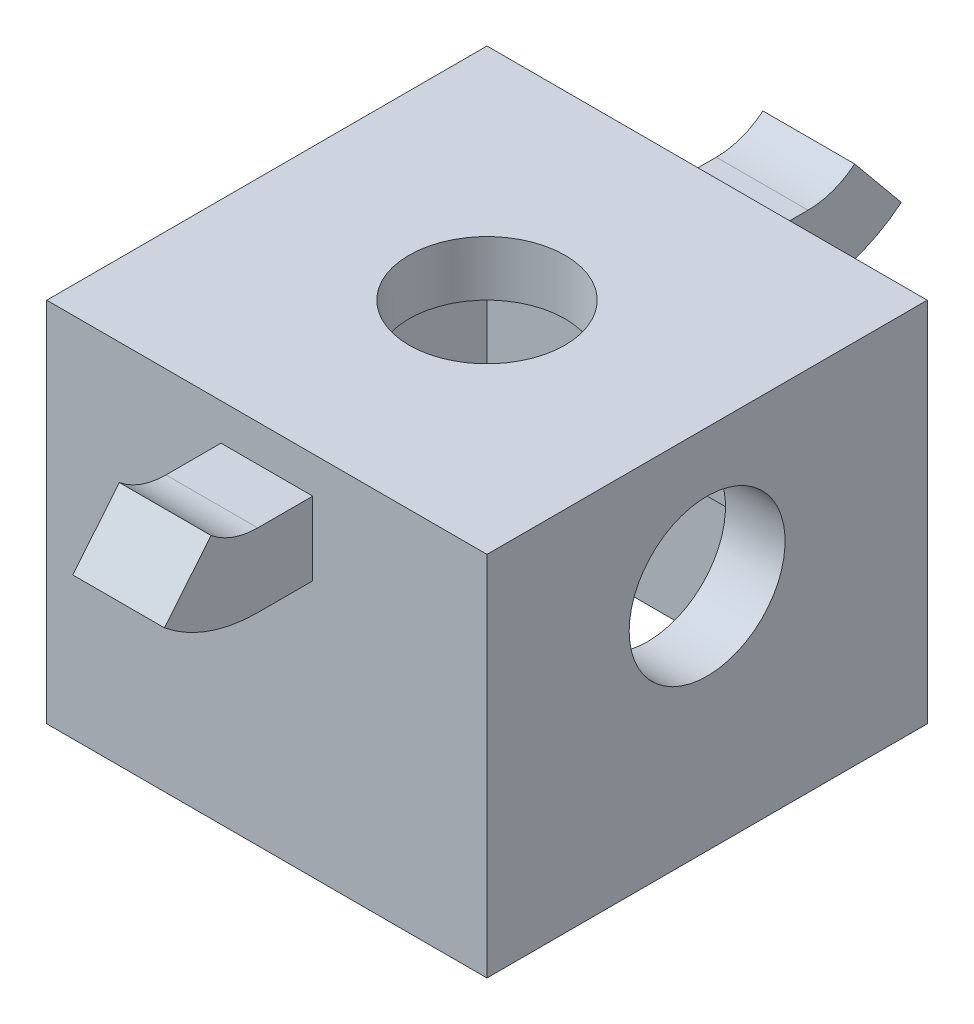
ISO-10303-21;
HEADER;
FILE_DESCRIPTION(('STEP AP214'),'2;1');
FILE_NAME('part.step','',(''),(''),'','','');
FILE_SCHEMA(('AUTOMOTIVE_DESIGN { 1 0 10303 214 1 1 1 1 }'));
ENDSEC;
DATA;
#1=APPLICATION_CONTEXT('core data for automotive mechanical design processes');
#2=APPLICATION_PROTOCOL_DEFINITION('international standard','automotive_design',2000,#1);
#3=PRODUCT_CONTEXT('',#1,'mechanical');
#4=PRODUCT('Part','Part','',(#3));
#5=PRODUCT_RELATED_PRODUCT_CATEGORY('part','',(#4));
#6=PRODUCT_DEFINITION_FORMATION('','',#4);
#7=PRODUCT_DEFINITION_CONTEXT('part definition',#1,'design');
#8=PRODUCT_DEFINITION('design','',#6,#7);
#9=PRODUCT_DEFINITION_SHAPE('','',#8);
#10=(LENGTH_UNIT() NAMED_UNIT(*) SI_UNIT(.MILLI.,.METRE.));
#11=(NAMED_UNIT(*) PLANE_ANGLE_UNIT() SI_UNIT($,.RADIAN.));
#12=(NAMED_UNIT(*) SI_UNIT($,.STERADIAN.) SOLID_ANGLE_UNIT());
#13=UNCERTAINTY_MEASURE_WITH_UNIT(LENGTH_MEASURE(1.E-05),#10,'distance_accuracy_value','');
#14=(GEOMETRIC_REPRESENTATION_CONTEXT(3) GLOBAL_UNCERTAINTY_ASSIGNED_CONTEXT((#13)) GLOBAL_UNIT_ASSIGNED_CONTEXT((#10,
#11,#12)) REPRESENTATION_CONTEXT('',''));
#15=CARTESIAN_POINT('',(0.,0.,0.));
#16=DIRECTION('',(0.,0.,1.));
#17=DIRECTION('',(1.,0.,0.));
#18=AXIS2_PLACEMENT_3D('',#15,#16,#17);
#19=CARTESIAN_POINT('',(12.,20.,-12.));
#20=DIRECTION('',(0.,0.,1.));
#21=DIRECTION('',(1.,0.,0.));
#22=AXIS2_PLACEMENT_3D('',#19,#20,#21);
#23=PLANE('',#22);
#24=DIRECTION('',(-1.,0.,0.));
#25=VECTOR('',#24,1.);
#26=CARTESIAN_POINT('',(12.,0.,-12.));
#27=LINE('',#26,#25);
#28=CARTESIAN_POINT('',(12.,0.,-12.));
#29=VERTEX_POINT('',#28);
#30=CARTESIAN_POINT('',(-12.,0.,-12.));
#31=VERTEX_POINT('',#30);
#32=EDGE_CURVE('E374',#29,#31,#27,.T.);
#33=ORIENTED_EDGE('',*,*,#32,.T.);
#34=DIRECTION('',(0.,-1.,0.));
#35=VECTOR('',#34,1.);
#36=CARTESIAN_POINT('',(-12.,20.,-12.));
#37=LINE('',#36,#35);
#38=CARTESIAN_POINT('',(-12.,20.,-12.));
#39=VERTEX_POINT('',#38);
#40=EDGE_CURVE('E380',#39,#31,#37,.T.);
#41=ORIENTED_EDGE('',*,*,#40,.F.);
#42=DIRECTION('',(-1.,0.,0.));
#43=VECTOR('',#42,1.);
#44=CARTESIAN_POINT('',(12.,20.,-12.));
#45=LINE('',#44,#43);
#46=CARTESIAN_POINT('',(12.,20.,-12.));
#47=VERTEX_POINT('',#46);
#48=EDGE_CURVE('E378',#47,#39,#45,.T.);
#49=ORIENTED_EDGE('',*,*,#48,.F.);
#50=DIRECTION('',(0.,-1.,0.));
#51=VECTOR('',#50,1.);
#52=CARTESIAN_POINT('',(12.,20.,-12.));
#53=LINE('',#52,#51);
#54=EDGE_CURVE('E390',#47,#29,#53,.T.);
#55=ORIENTED_EDGE('',*,*,#54,.T.);
#56=EDGE_LOOP('',(#33,#41,#49,#55));
#57=FACE_BOUND('',#56,.T.);
#58=DIRECTION('',(0.,-1.,0.));
#59=VECTOR('',#58,1.);
#60=CARTESIAN_POINT('',(2.50000000000001,18.,-12.));
#61=LINE('',#60,#59);
#62=CARTESIAN_POINT('',(2.50000000000001,18.,-12.));
#63=VERTEX_POINT('',#62);
#64=CARTESIAN_POINT('',(2.50000000000001,14.,-12.));
#65=VERTEX_POINT('',#64);
#66=EDGE_CURVE('E315',#63,#65,#61,.T.);
#67=ORIENTED_EDGE('',*,*,#66,.F.);
#68=DIRECTION('',(1.,0.,0.));
#69=VECTOR('',#68,1.);
#70=CARTESIAN_POINT('',(-2.49999999999999,18.,-12.));
#71=LINE('',#70,#69);
#72=CARTESIAN_POINT('',(-2.5,18.,-12.));
#73=VERTEX_POINT('',#72);
#74=EDGE_CURVE('E320',#73,#63,#71,.T.);
#75=ORIENTED_EDGE('',*,*,#74,.F.);
#76=DIRECTION('',(0.,1.,0.));
#77=VECTOR('',#76,1.);
#78=CARTESIAN_POINT('',(-2.49999999999999,18.,-12.));
#79=LINE('',#78,#77);
#80=CARTESIAN_POINT('',(-2.5,14.,-12.));
#81=VERTEX_POINT('',#80);
#82=EDGE_CURVE('E329',#81,#73,#79,.T.);
#83=ORIENTED_EDGE('',*,*,#82,.F.);
#84=DIRECTION('',(-1.,0.,0.));
#85=VECTOR('',#84,1.);
#86=CARTESIAN_POINT('',(-2.49999999999999,14.,-12.));
#87=LINE('',#86,#85);
#88=EDGE_CURVE('E326',#65,#81,#87,.T.);
#89=ORIENTED_EDGE('',*,*,#88,.F.);
#90=EDGE_LOOP('',(#67,#75,#83,#89));
#91=FACE_BOUND('',#90,.T.);
#92=ADVANCED_FACE('F35',(#57,#91),#23,.F.);
#93=CARTESIAN_POINT('',(-12.,20.,12.));
#94=DIRECTION('',(1.,0.,0.));
#95=DIRECTION('',(0.,0.,-1.));
#96=AXIS2_PLACEMENT_3D('',#93,#94,#95);
#97=PLANE('',#96);
#98=DIRECTION('',(0.,0.,1.));
#99=VECTOR('',#98,1.);
#100=CARTESIAN_POINT('',(-12.,0.,12.));
#101=LINE('',#100,#99);
#102=CARTESIAN_POINT('',(-12.,0.,12.));
#103=VERTEX_POINT('',#102);
#104=EDGE_CURVE('E369',#31,#103,#101,.T.);
#105=ORIENTED_EDGE('',*,*,#104,.T.);
#106=DIRECTION('',(0.,-1.,0.));
#107=VECTOR('',#106,1.);
#108=CARTESIAN_POINT('',(-12.,20.,12.));
#109=LINE('',#108,#107);
#110=CARTESIAN_POINT('',(-12.,20.,12.));
#111=VERTEX_POINT('',#110);
#112=EDGE_CURVE('E11',#111,#103,#109,.T.);
#113=ORIENTED_EDGE('',*,*,#112,.F.);
#114=DIRECTION('',(0.,0.,1.));
#115=VECTOR('',#114,1.);
#116=CARTESIAN_POINT('',(-12.,20.,12.));
#117=LINE('',#116,#115);
#118=EDGE_CURVE('E370',#39,#111,#117,.T.);
#119=ORIENTED_EDGE('',*,*,#118,.F.);
#120=ORIENTED_EDGE('',*,*,#40,.T.);
#121=EDGE_LOOP('',(#105,#113,#119,#120));
#122=FACE_BOUND('',#121,.T.);
#123=ADVANCED_FACE('F37',(#122),#97,.F.);
#124=CARTESIAN_POINT('',(12.,20.,12.));
#125=DIRECTION('',(0.,0.,-1.));
#126=DIRECTION('',(-1.,0.,0.));
#127=AXIS2_PLACEMENT_3D('',#124,#125,#126);
#128=PLANE('',#127);
#129=DIRECTION('',(1.,0.,0.));
#130=VECTOR('',#129,1.);
#131=CARTESIAN_POINT('',(-2.49999999999999,18.,12.));
#132=LINE('',#131,#130);
#133=CARTESIAN_POINT('',(-2.49999999999999,18.,12.));
#134=VERTEX_POINT('',#133);
#135=CARTESIAN_POINT('',(2.50000000000001,18.,12.));
#136=VERTEX_POINT('',#135);
#137=EDGE_CURVE('E279',#134,#136,#132,.T.);
#138=ORIENTED_EDGE('',*,*,#137,.T.);
#139=DIRECTION('',(0.,-1.,0.));
#140=VECTOR('',#139,1.);
#141=CARTESIAN_POINT('',(2.50000000000001,18.,12.));
#142=LINE('',#141,#140);
#143=CARTESIAN_POINT('',(2.5,14.,12.));
#144=VERTEX_POINT('',#143);
#145=EDGE_CURVE('E263',#136,#144,#142,.T.);
#146=ORIENTED_EDGE('',*,*,#145,.T.);
#147=DIRECTION('',(-1.,0.,0.));
#148=VECTOR('',#147,1.);
#149=CARTESIAN_POINT('',(-2.49999999999999,14.,12.));
#150=LINE('',#149,#148);
#151=CARTESIAN_POINT('',(-2.5,14.,12.));
#152=VERTEX_POINT('',#151);
#153=EDGE_CURVE('E273',#144,#152,#150,.T.);
#154=ORIENTED_EDGE('',*,*,#153,.T.);
#155=DIRECTION('',(0.,1.,0.));
#156=VECTOR('',#155,1.);
#157=CARTESIAN_POINT('',(-2.49999999999999,18.,12.));
#158=LINE('',#157,#156);
#159=EDGE_CURVE('E282',#152,#134,#158,.T.);
#160=ORIENTED_EDGE('',*,*,#159,.T.);
#161=EDGE_LOOP('',(#138,#146,#154,#160));
#162=FACE_BOUND('',#161,.T.);
#163=DIRECTION('',(1.,0.,0.));
#164=VECTOR('',#163,1.);
#165=CARTESIAN_POINT('',(12.,0.,12.));
#166=LINE('',#165,#164);
#167=CARTESIAN_POINT('',(12.,0.,12.));
#168=VERTEX_POINT('',#167);
#169=EDGE_CURVE('E383',#103,#168,#166,.T.);
#170=ORIENTED_EDGE('',*,*,#169,.T.);
#171=DIRECTION('',(0.,-1.,0.));
#172=VECTOR('',#171,1.);
#173=CARTESIAN_POINT('',(12.,20.,12.));
#174=LINE('',#173,#172);
#175=CARTESIAN_POINT('',(12.,20.,12.));
#176=VERTEX_POINT('',#175);
#177=EDGE_CURVE('E43',#176,#168,#174,.T.);
#178=ORIENTED_EDGE('',*,*,#177,.F.);
#179=DIRECTION('',(1.,0.,0.));
#180=VECTOR('',#179,1.);
#181=CARTESIAN_POINT('',(12.,20.,12.));
#182=LINE('',#181,#180);
#183=EDGE_CURVE('E373',#111,#176,#182,.T.);
#184=ORIENTED_EDGE('',*,*,#183,.F.);
#185=ORIENTED_EDGE('',*,*,#112,.T.);
#186=EDGE_LOOP('',(#170,#178,#184,#185));
#187=FACE_BOUND('',#186,.T.);
#188=ADVANCED_FACE('F413',(#162,#187),#128,.F.);
#189=CARTESIAN_POINT('',(12.,20.,12.));
#190=DIRECTION('',(-1.,0.,0.));
#191=DIRECTION('',(0.,0.,1.));
#192=AXIS2_PLACEMENT_3D('',#189,#190,#191);
#193=PLANE('',#192);
#194=CARTESIAN_POINT('',(12.,12.5,0.));
#195=DIRECTION('',(-1.,0.,0.));
#196=DIRECTION('',(0.,0.,1.));
#197=AXIS2_PLACEMENT_3D('',#194,#195,#196);
#198=CIRCLE('',#197,4.25);
#199=CARTESIAN_POINT('',(12.,12.5,4.25));
#200=VERTEX_POINT('',#199);
#201=EDGE_CURVE('E538',#200,#200,#198,.F.);
#202=ORIENTED_EDGE('',*,*,#201,.F.);
#203=EDGE_LOOP('',(#202));
#204=FACE_BOUND('',#203,.T.);
#205=DIRECTION('',(0.,0.,-1.));
#206=VECTOR('',#205,1.);
#207=CARTESIAN_POINT('',(12.,0.,12.));
#208=LINE('',#207,#206);
#209=EDGE_CURVE('E385',#168,#29,#208,.T.);
#210=ORIENTED_EDGE('',*,*,#209,.T.);
#211=ORIENTED_EDGE('',*,*,#54,.F.);
#212=DIRECTION('',(0.,0.,-1.));
#213=VECTOR('',#212,1.);
#214=CARTESIAN_POINT('',(12.,20.,12.));
#215=LINE('',#214,#213);
#216=EDGE_CURVE('E376',#176,#47,#215,.T.);
#217=ORIENTED_EDGE('',*,*,#216,.F.);
#218=ORIENTED_EDGE('',*,*,#177,.T.);
#219=EDGE_LOOP('',(#210,#211,#217,#218));
#220=FACE_BOUND('',#219,.T.);
#221=ADVANCED_FACE('F397',(#204,#220),#193,.F.);
#222=CARTESIAN_POINT('',(0.,20.,0.));
#223=DIRECTION('',(0.,1.,0.));
#224=DIRECTION('',(0.,0.,1.));
#225=AXIS2_PLACEMENT_3D('',#222,#223,#224);
#226=PLANE('',#225);
#227=CARTESIAN_POINT('',(0.,20.,0.));
#228=DIRECTION('',(0.,1.,0.));
#229=DIRECTION('',(0.,0.,1.));
#230=AXIS2_PLACEMENT_3D('',#227,#228,#229);
#231=CIRCLE('',#230,4.25);
#232=CARTESIAN_POINT('',(0.,20.,4.25));
#233=VERTEX_POINT('',#232);
#234=EDGE_CURVE('E222',#233,#233,#231,.F.);
#235=ORIENTED_EDGE('',*,*,#234,.T.);
#236=EDGE_LOOP('',(#235));
#237=FACE_BOUND('',#236,.T.);
#238=ORIENTED_EDGE('',*,*,#118,.T.);
#239=ORIENTED_EDGE('',*,*,#183,.T.);
#240=ORIENTED_EDGE('',*,*,#216,.T.);
#241=ORIENTED_EDGE('',*,*,#48,.T.);
#242=EDGE_LOOP('',(#238,#239,#240,#241));
#243=FACE_BOUND('',#242,.T.);
#244=ADVANCED_FACE('F412',(#237,#243),#226,.T.);
#245=CARTESIAN_POINT('',(0.,0.,0.));
#246=DIRECTION('',(0.,1.,0.));
#247=DIRECTION('',(0.,0.,1.));
#248=AXIS2_PLACEMENT_3D('',#245,#246,#247);
#249=PLANE('',#248);
#250=DIRECTION('',(-1.,0.,0.));
#251=VECTOR('',#250,1.);
#252=CARTESIAN_POINT('',(-10.,0.,10.));
#253=LINE('',#252,#251);
#254=CARTESIAN_POINT('',(10.,0.,10.));
#255=VERTEX_POINT('',#254);
#256=CARTESIAN_POINT('',(-10.,0.,10.));
#257=VERTEX_POINT('',#256);
#258=EDGE_CURVE('E251',#255,#257,#253,.T.);
#259=ORIENTED_EDGE('',*,*,#258,.F.);
#260=DIRECTION('',(0.,0.,1.));
#261=VECTOR('',#260,1.);
#262=CARTESIAN_POINT('',(10.,0.,-10.));
#263=LINE('',#262,#261);
#264=CARTESIAN_POINT('',(10.,0.,-10.));
#265=VERTEX_POINT('',#264);
#266=EDGE_CURVE('E58',#265,#255,#263,.T.);
#267=ORIENTED_EDGE('',*,*,#266,.F.);
#268=DIRECTION('',(1.,0.,0.));
#269=VECTOR('',#268,1.);
#270=CARTESIAN_POINT('',(-10.,0.,-10.));
#271=LINE('',#270,#269);
#272=CARTESIAN_POINT('',(-10.,0.,-10.));
#273=VERTEX_POINT('',#272);
#274=EDGE_CURVE('E257',#273,#265,#271,.T.);
#275=ORIENTED_EDGE('',*,*,#274,.F.);
#276=DIRECTION('',(0.,0.,-1.));
#277=VECTOR('',#276,1.);
#278=CARTESIAN_POINT('',(-10.,0.,-10.));
#279=LINE('',#278,#277);
#280=EDGE_CURVE('E254',#257,#273,#279,.T.);
#281=ORIENTED_EDGE('',*,*,#280,.F.);
#282=EDGE_LOOP('',(#259,#267,#275,#281));
#283=FACE_BOUND('',#282,.T.);
#284=ORIENTED_EDGE('',*,*,#104,.F.);
#285=ORIENTED_EDGE('',*,*,#32,.F.);
#286=ORIENTED_EDGE('',*,*,#209,.F.);
#287=ORIENTED_EDGE('',*,*,#169,.F.);
#288=EDGE_LOOP('',(#284,#285,#286,#287));
#289=FACE_BOUND('',#288,.T.);
#290=ADVANCED_FACE('F403',(#283,#289),#249,.F.);
#291=CARTESIAN_POINT('',(0.,22.,-15.));
#292=DIRECTION('',(1.,0.,0.));
#293=DIRECTION('',(0.,0.,-1.));
#294=AXIS2_PLACEMENT_3D('',#291,#292,#293);
#295=CYLINDRICAL_SURFACE('',#294,8.);
#296=DIRECTION('',(-1.,0.,0.));
#297=VECTOR('',#296,1.);
#298=CARTESIAN_POINT('',(-2.49999999999999,14.,-15.));
#299=LINE('',#298,#297);
#300=CARTESIAN_POINT('',(2.5,14.,-15.));
#301=VERTEX_POINT('',#300);
#302=CARTESIAN_POINT('',(-2.49999999999999,14.,-15.));
#303=VERTEX_POINT('',#302);
#304=EDGE_CURVE('E316',#301,#303,#299,.T.);
#305=ORIENTED_EDGE('',*,*,#304,.T.);
#306=CARTESIAN_POINT('',(-2.49999999999999,22.,-15.));
#307=DIRECTION('',(1.,0.,0.));
#308=DIRECTION('',(0.,0.,-1.));
#309=AXIS2_PLACEMENT_3D('',#306,#307,#308);
#310=CIRCLE('',#309,8.);
#311=CARTESIAN_POINT('',(-2.49999999999999,15.8236304445881,-20.0845313564753));
#312=VERTEX_POINT('',#311);
#313=EDGE_CURVE('E363',#303,#312,#310,.T.);
#314=ORIENTED_EDGE('',*,*,#313,.T.);
#315=DIRECTION('',(-1.,0.,0.));
#316=VECTOR('',#315,1.);
#317=CARTESIAN_POINT('',(-2.49999999999999,15.8236304445881,-20.0845313564753));
#318=LINE('',#317,#316);
#319=CARTESIAN_POINT('',(2.5,15.8236304445881,-20.0845313564753));
#320=VERTEX_POINT('',#319);
#321=EDGE_CURVE('E354',#320,#312,#318,.T.);
#322=ORIENTED_EDGE('',*,*,#321,.F.);
#323=CARTESIAN_POINT('',(2.5,22.,-15.));
#324=DIRECTION('',(1.,0.,0.));
#325=DIRECTION('',(0.,0.,-1.));
#326=AXIS2_PLACEMENT_3D('',#323,#324,#325);
#327=CIRCLE('',#326,8.);
#328=EDGE_CURVE('E366',#301,#320,#327,.T.);
#329=ORIENTED_EDGE('',*,*,#328,.F.);
#330=EDGE_LOOP('',(#305,#314,#322,#329));
#331=FACE_BOUND('',#330,.T.);
#332=ADVANCED_FACE('F429',(#331),#295,.T.);
#333=CARTESIAN_POINT('',(0.,22.,-15.));
#334=DIRECTION('',(1.,0.,0.));
#335=DIRECTION('',(0.,0.,-1.));
#336=AXIS2_PLACEMENT_3D('',#333,#334,#335);
#337=CYLINDRICAL_SURFACE('',#336,4.);
#338=DIRECTION('',(1.,0.,0.));
#339=VECTOR('',#338,1.);
#340=CARTESIAN_POINT('',(-2.49999999999999,18.,-15.));
#341=LINE('',#340,#339);
#342=CARTESIAN_POINT('',(-2.49999999999999,18.,-15.));
#343=VERTEX_POINT('',#342);
#344=CARTESIAN_POINT('',(2.50000000000001,18.,-15.));
#345=VERTEX_POINT('',#344);
#346=EDGE_CURVE('E319',#343,#345,#341,.T.);
#347=ORIENTED_EDGE('',*,*,#346,.T.);
#348=CARTESIAN_POINT('',(2.50000000000001,22.,-15.));
#349=DIRECTION('',(1.,0.,0.));
#350=DIRECTION('',(0.,0.,-1.));
#351=AXIS2_PLACEMENT_3D('',#348,#349,#350);
#352=CIRCLE('',#351,4.);
#353=CARTESIAN_POINT('',(2.50000000000001,18.911815222294,-17.5422656782377));
#354=VERTEX_POINT('',#353);
#355=EDGE_CURVE('E357',#345,#354,#352,.T.);
#356=ORIENTED_EDGE('',*,*,#355,.T.);
#357=DIRECTION('',(1.,0.,0.));
#358=VECTOR('',#357,1.);
#359=CARTESIAN_POINT('',(-2.49999999999999,18.911815222294,-17.5422656782377));
#360=LINE('',#359,#358);
#361=CARTESIAN_POINT('',(-2.49999999999999,18.911815222294,-17.5422656782377));
#362=VERTEX_POINT('',#361);
#363=EDGE_CURVE('E348',#362,#354,#360,.T.);
#364=ORIENTED_EDGE('',*,*,#363,.F.);
#365=CARTESIAN_POINT('',(-2.49999999999999,22.,-15.));
#366=DIRECTION('',(1.,0.,0.));
#367=DIRECTION('',(0.,0.,-1.));
#368=AXIS2_PLACEMENT_3D('',#365,#366,#367);
#369=CIRCLE('',#368,4.);
#370=EDGE_CURVE('E360',#343,#362,#369,.T.);
#371=ORIENTED_EDGE('',*,*,#370,.F.);
#372=EDGE_LOOP('',(#347,#356,#364,#371));
#373=FACE_BOUND('',#372,.T.);
#374=ADVANCED_FACE('F436',(#373),#337,.F.);
#375=CARTESIAN_POINT('',(2.50000000000001,18.,-15.));
#376=DIRECTION('',(-1.,0.,0.));
#377=DIRECTION('',(0.,-1.,0.));
#378=AXIS2_PLACEMENT_3D('',#375,#376,#377);
#379=PLANE('',#378);
#380=ORIENTED_EDGE('',*,*,#66,.T.);
#381=DIRECTION('',(0.,0.,1.));
#382=VECTOR('',#381,1.);
#383=CARTESIAN_POINT('',(2.5,14.,-15.));
#384=LINE('',#383,#382);
#385=EDGE_CURVE('E342',#301,#65,#384,.T.);
#386=ORIENTED_EDGE('',*,*,#385,.F.);
#387=ORIENTED_EDGE('',*,*,#328,.T.);
#388=DIRECTION('',(0.,-0.77204619442649,-0.635566419559415));
#389=VECTOR('',#388,1.);
#390=CARTESIAN_POINT('',(2.50000000000001,18.911815222294,-17.5422656782377));
#391=LINE('',#390,#389);
#392=EDGE_CURVE('E345',#354,#320,#391,.T.);
#393=ORIENTED_EDGE('',*,*,#392,.F.);
#394=ORIENTED_EDGE('',*,*,#355,.F.);
#395=DIRECTION('',(0.,0.,1.));
#396=VECTOR('',#395,1.);
#397=CARTESIAN_POINT('',(2.50000000000001,18.,-15.));
#398=LINE('',#397,#396);
#399=EDGE_CURVE('E323',#345,#63,#398,.T.);
#400=ORIENTED_EDGE('',*,*,#399,.T.);
#401=EDGE_LOOP('',(#380,#386,#387,#393,#394,#400));
#402=FACE_BOUND('',#401,.T.);
#403=ADVANCED_FACE('F440',(#402),#379,.F.);
#404=CARTESIAN_POINT('',(-2.49999999999999,14.,-15.));
#405=DIRECTION('',(0.,1.,0.));
#406=DIRECTION('',(0.,0.,1.));
#407=AXIS2_PLACEMENT_3D('',#404,#405,#406);
#408=PLANE('',#407);
#409=ORIENTED_EDGE('',*,*,#88,.T.);
#410=DIRECTION('',(0.,0.,1.));
#411=VECTOR('',#410,1.);
#412=CARTESIAN_POINT('',(-2.49999999999999,14.,-15.));
#413=LINE('',#412,#411);
#414=EDGE_CURVE('E339',#303,#81,#413,.T.);
#415=ORIENTED_EDGE('',*,*,#414,.F.);
#416=ORIENTED_EDGE('',*,*,#304,.F.);
#417=ORIENTED_EDGE('',*,*,#385,.T.);
#418=EDGE_LOOP('',(#409,#415,#416,#417));
#419=FACE_BOUND('',#418,.T.);
#420=ADVANCED_FACE('F444',(#419),#408,.F.);
#421=CARTESIAN_POINT('',(-2.49999999999999,18.,-15.));
#422=DIRECTION('',(1.,0.,0.));
#423=DIRECTION('',(0.,0.,-1.));
#424=AXIS2_PLACEMENT_3D('',#421,#422,#423);
#425=PLANE('',#424);
#426=ORIENTED_EDGE('',*,*,#82,.T.);
#427=DIRECTION('',(0.,0.,1.));
#428=VECTOR('',#427,1.);
#429=CARTESIAN_POINT('',(-2.49999999999999,18.,-15.));
#430=LINE('',#429,#428);
#431=EDGE_CURVE('E336',#343,#73,#430,.T.);
#432=ORIENTED_EDGE('',*,*,#431,.F.);
#433=ORIENTED_EDGE('',*,*,#370,.T.);
#434=DIRECTION('',(0.,0.77204619442649,0.635566419559415));
#435=VECTOR('',#434,1.);
#436=CARTESIAN_POINT('',(-2.49999999999999,18.911815222294,-17.5422656782377));
#437=LINE('',#436,#435);
#438=EDGE_CURVE('E351',#312,#362,#437,.T.);
#439=ORIENTED_EDGE('',*,*,#438,.F.);
#440=ORIENTED_EDGE('',*,*,#313,.F.);
#441=ORIENTED_EDGE('',*,*,#414,.T.);
#442=EDGE_LOOP('',(#426,#432,#433,#439,#440,#441));
#443=FACE_BOUND('',#442,.T.);
#444=ADVANCED_FACE('F448',(#443),#425,.F.);
#445=CARTESIAN_POINT('',(-2.49999999999999,18.,-15.));
#446=DIRECTION('',(0.,-1.,0.));
#447=DIRECTION('',(0.,0.,-1.));
#448=AXIS2_PLACEMENT_3D('',#445,#446,#447);
#449=PLANE('',#448);
#450=ORIENTED_EDGE('',*,*,#74,.T.);
#451=ORIENTED_EDGE('',*,*,#399,.F.);
#452=ORIENTED_EDGE('',*,*,#346,.F.);
#453=ORIENTED_EDGE('',*,*,#431,.T.);
#454=EDGE_LOOP('',(#450,#451,#452,#453));
#455=FACE_BOUND('',#454,.T.);
#456=ADVANCED_FACE('F452',(#455),#449,.F.);
#457=CARTESIAN_POINT('',(0.,5.01498372261722,-28.9824612303071));
#458=DIRECTION('',(0.,-0.635566419559415,0.77204619442649));
#459=DIRECTION('',(1.,0.,0.));
#460=AXIS2_PLACEMENT_3D('',#457,#458,#459);
#461=PLANE('',#460);
#462=ORIENTED_EDGE('',*,*,#392,.T.);
#463=ORIENTED_EDGE('',*,*,#321,.T.);
#464=ORIENTED_EDGE('',*,*,#438,.T.);
#465=ORIENTED_EDGE('',*,*,#363,.T.);
#466=EDGE_LOOP('',(#462,#463,#464,#465));
#467=FACE_BOUND('',#466,.T.);
#468=ADVANCED_FACE('F456',(#467),#461,.F.);
#469=CARTESIAN_POINT('',(0.,22.,15.));
#470=DIRECTION('',(-1.,0.,0.));
#471=DIRECTION('',(0.,0.,1.));
#472=AXIS2_PLACEMENT_3D('',#469,#470,#471);
#473=CYLINDRICAL_SURFACE('',#472,4.);
#474=DIRECTION('',(1.,0.,0.));
#475=VECTOR('',#474,1.);
#476=CARTESIAN_POINT('',(-2.49999999999999,18.,15.));
#477=LINE('',#476,#475);
#478=CARTESIAN_POINT('',(-2.49999999999999,18.,15.));
#479=VERTEX_POINT('',#478);
#480=CARTESIAN_POINT('',(2.50000000000001,18.,15.));
#481=VERTEX_POINT('',#480);
#482=EDGE_CURVE('E269',#479,#481,#477,.T.);
#483=ORIENTED_EDGE('',*,*,#482,.F.);
#484=CARTESIAN_POINT('',(-2.49999999999999,22.,15.));
#485=DIRECTION('',(-1.,0.,0.));
#486=DIRECTION('',(0.,0.,1.));
#487=AXIS2_PLACEMENT_3D('',#484,#485,#486);
#488=CIRCLE('',#487,4.);
#489=CARTESIAN_POINT('',(-2.49999999999999,18.911815222294,17.5422656782377));
#490=VERTEX_POINT('',#489);
#491=EDGE_CURVE('E309',#479,#490,#488,.T.);
#492=ORIENTED_EDGE('',*,*,#491,.T.);
#493=DIRECTION('',(1.,0.,0.));
#494=VECTOR('',#493,1.);
#495=CARTESIAN_POINT('',(-2.49999999999999,18.911815222294,17.5422656782377));
#496=LINE('',#495,#494);
#497=CARTESIAN_POINT('',(2.50000000000001,18.911815222294,17.5422656782377));
#498=VERTEX_POINT('',#497);
#499=EDGE_CURVE('E301',#490,#498,#496,.T.);
#500=ORIENTED_EDGE('',*,*,#499,.T.);
#501=CARTESIAN_POINT('',(2.50000000000001,22.,15.));
#502=DIRECTION('',(-1.,0.,0.));
#503=DIRECTION('',(0.,0.,1.));
#504=AXIS2_PLACEMENT_3D('',#501,#502,#503);
#505=CIRCLE('',#504,4.);
#506=EDGE_CURVE('E312',#481,#498,#505,.T.);
#507=ORIENTED_EDGE('',*,*,#506,.F.);
#508=EDGE_LOOP('',(#483,#492,#500,#507));
#509=FACE_BOUND('',#508,.T.);
#510=ADVANCED_FACE('F460',(#509),#473,.F.);
#511=CARTESIAN_POINT('',(0.,22.,15.));
#512=DIRECTION('',(-1.,0.,0.));
#513=DIRECTION('',(0.,0.,1.));
#514=AXIS2_PLACEMENT_3D('',#511,#512,#513);
#515=CYLINDRICAL_SURFACE('',#514,8.);
#516=DIRECTION('',(-1.,0.,0.));
#517=VECTOR('',#516,1.);
#518=CARTESIAN_POINT('',(-2.49999999999999,14.,15.));
#519=LINE('',#518,#517);
#520=CARTESIAN_POINT('',(2.5,14.,15.));
#521=VERTEX_POINT('',#520);
#522=CARTESIAN_POINT('',(-2.49999999999999,14.,15.));
#523=VERTEX_POINT('',#522);
#524=EDGE_CURVE('E272',#521,#523,#519,.T.);
#525=ORIENTED_EDGE('',*,*,#524,.F.);
#526=CARTESIAN_POINT('',(2.5,22.,15.));
#527=DIRECTION('',(-1.,0.,0.));
#528=DIRECTION('',(0.,0.,1.));
#529=AXIS2_PLACEMENT_3D('',#526,#527,#528);
#530=CIRCLE('',#529,8.);
#531=CARTESIAN_POINT('',(2.5,15.8236304445881,20.0845313564753));
#532=VERTEX_POINT('',#531);
#533=EDGE_CURVE('E303',#521,#532,#530,.T.);
#534=ORIENTED_EDGE('',*,*,#533,.T.);
#535=DIRECTION('',(-1.,0.,0.));
#536=VECTOR('',#535,1.);
#537=CARTESIAN_POINT('',(-2.49999999999999,15.8236304445881,20.0845313564753));
#538=LINE('',#537,#536);
#539=CARTESIAN_POINT('',(-2.49999999999999,15.8236304445881,20.0845313564753));
#540=VERTEX_POINT('',#539);
#541=EDGE_CURVE('E297',#532,#540,#538,.T.);
#542=ORIENTED_EDGE('',*,*,#541,.T.);
#543=CARTESIAN_POINT('',(-2.49999999999999,22.,15.));
#544=DIRECTION('',(-1.,0.,0.));
#545=DIRECTION('',(0.,0.,1.));
#546=AXIS2_PLACEMENT_3D('',#543,#544,#545);
#547=CIRCLE('',#546,8.);
#548=EDGE_CURVE('E306',#523,#540,#547,.T.);
#549=ORIENTED_EDGE('',*,*,#548,.F.);
#550=EDGE_LOOP('',(#525,#534,#542,#549));
#551=FACE_BOUND('',#550,.T.);
#552=ADVANCED_FACE('F464',(#551),#515,.T.);
#553=CARTESIAN_POINT('',(2.50000000000001,18.,15.));
#554=DIRECTION('',(1.,0.,0.));
#555=DIRECTION('',(0.,1.,0.));
#556=AXIS2_PLACEMENT_3D('',#553,#554,#555);
#557=PLANE('',#556);
#558=ORIENTED_EDGE('',*,*,#145,.F.);
#559=DIRECTION('',(0.,0.,-1.));
#560=VECTOR('',#559,1.);
#561=CARTESIAN_POINT('',(2.50000000000001,18.,15.));
#562=LINE('',#561,#560);
#563=EDGE_CURVE('E293',#481,#136,#562,.T.);
#564=ORIENTED_EDGE('',*,*,#563,.F.);
#565=ORIENTED_EDGE('',*,*,#506,.T.);
#566=DIRECTION('',(0.,-0.77204619442649,0.635566419559415));
#567=VECTOR('',#566,1.);
#568=CARTESIAN_POINT('',(2.50000000000001,18.911815222294,17.5422656782377));
#569=LINE('',#568,#567);
#570=EDGE_CURVE('E295',#498,#532,#569,.T.);
#571=ORIENTED_EDGE('',*,*,#570,.T.);
#572=ORIENTED_EDGE('',*,*,#533,.F.);
#573=DIRECTION('',(0.,0.,-1.));
#574=VECTOR('',#573,1.);
#575=CARTESIAN_POINT('',(2.5,14.,15.));
#576=LINE('',#575,#574);
#577=EDGE_CURVE('E276',#521,#144,#576,.T.);
#578=ORIENTED_EDGE('',*,*,#577,.T.);
#579=EDGE_LOOP('',(#558,#564,#565,#571,#572,#578));
#580=FACE_BOUND('',#579,.T.);
#581=ADVANCED_FACE('F468',(#580),#557,.T.);
#582=CARTESIAN_POINT('',(-2.49999999999999,18.,15.));
#583=DIRECTION('',(0.,1.,0.));
#584=DIRECTION('',(0.,0.,1.));
#585=AXIS2_PLACEMENT_3D('',#582,#583,#584);
#586=PLANE('',#585);
#587=ORIENTED_EDGE('',*,*,#137,.F.);
#588=DIRECTION('',(0.,0.,-1.));
#589=VECTOR('',#588,1.);
#590=CARTESIAN_POINT('',(-2.49999999999999,18.,15.));
#591=LINE('',#590,#589);
#592=EDGE_CURVE('E291',#479,#134,#591,.T.);
#593=ORIENTED_EDGE('',*,*,#592,.F.);
#594=ORIENTED_EDGE('',*,*,#482,.T.);
#595=ORIENTED_EDGE('',*,*,#563,.T.);
#596=EDGE_LOOP('',(#587,#593,#594,#595));
#597=FACE_BOUND('',#596,.T.);
#598=ADVANCED_FACE('F472',(#597),#586,.T.);
#599=CARTESIAN_POINT('',(-2.49999999999999,18.,15.));
#600=DIRECTION('',(-1.,0.,0.));
#601=DIRECTION('',(0.,0.,1.));
#602=AXIS2_PLACEMENT_3D('',#599,#600,#601);
#603=PLANE('',#602);
#604=ORIENTED_EDGE('',*,*,#159,.F.);
#605=DIRECTION('',(0.,0.,-1.));
#606=VECTOR('',#605,1.);
#607=CARTESIAN_POINT('',(-2.49999999999999,14.,15.));
#608=LINE('',#607,#606);
#609=EDGE_CURVE('E288',#523,#152,#608,.T.);
#610=ORIENTED_EDGE('',*,*,#609,.F.);
#611=ORIENTED_EDGE('',*,*,#548,.T.);
#612=DIRECTION('',(0.,0.77204619442649,-0.635566419559415));
#613=VECTOR('',#612,1.);
#614=CARTESIAN_POINT('',(-2.49999999999999,18.911815222294,17.5422656782377));
#615=LINE('',#614,#613);
#616=EDGE_CURVE('E299',#540,#490,#615,.T.);
#617=ORIENTED_EDGE('',*,*,#616,.T.);
#618=ORIENTED_EDGE('',*,*,#491,.F.);
#619=ORIENTED_EDGE('',*,*,#592,.T.);
#620=EDGE_LOOP('',(#604,#610,#611,#617,#618,#619));
#621=FACE_BOUND('',#620,.T.);
#622=ADVANCED_FACE('F476',(#621),#603,.T.);
#623=CARTESIAN_POINT('',(-2.49999999999999,14.,15.));
#624=DIRECTION('',(0.,-1.,0.));
#625=DIRECTION('',(0.,0.,-1.));
#626=AXIS2_PLACEMENT_3D('',#623,#624,#625);
#627=PLANE('',#626);
#628=ORIENTED_EDGE('',*,*,#153,.F.);
#629=ORIENTED_EDGE('',*,*,#577,.F.);
#630=ORIENTED_EDGE('',*,*,#524,.T.);
#631=ORIENTED_EDGE('',*,*,#609,.T.);
#632=EDGE_LOOP('',(#628,#629,#630,#631));
#633=FACE_BOUND('',#632,.T.);
#634=ADVANCED_FACE('F480',(#633),#627,.T.);
#635=CARTESIAN_POINT('',(0.,5.01498372261722,28.9824612303071));
#636=DIRECTION('',(0.,-0.635566419559415,-0.77204619442649));
#637=DIRECTION('',(1.,0.,0.));
#638=AXIS2_PLACEMENT_3D('',#635,#636,#637);
#639=PLANE('',#638);
#640=ORIENTED_EDGE('',*,*,#570,.F.);
#641=ORIENTED_EDGE('',*,*,#499,.F.);
#642=ORIENTED_EDGE('',*,*,#616,.F.);
#643=ORIENTED_EDGE('',*,*,#541,.F.);
#644=EDGE_LOOP('',(#640,#641,#642,#643));
#645=FACE_BOUND('',#644,.T.);
#646=ADVANCED_FACE('F484',(#645),#639,.F.);
#647=CARTESIAN_POINT('',(10.,6.,-10.));
#648=DIRECTION('',(1.,0.,0.));
#649=DIRECTION('',(0.,0.,-1.));
#650=AXIS2_PLACEMENT_3D('',#647,#648,#649);
#651=PLANE('',#650);
#652=ORIENTED_EDGE('',*,*,#266,.T.);
#653=DIRECTION('',(0.,-1.,0.));
#654=VECTOR('',#653,1.);
#655=CARTESIAN_POINT('',(10.,6.,10.));
#656=LINE('',#655,#654);
#657=CARTESIAN_POINT('',(10.,8.,10.));
#658=VERTEX_POINT('',#657);
#659=EDGE_CURVE('E260',#658,#255,#656,.T.);
#660=ORIENTED_EDGE('',*,*,#659,.F.);
#661=DIRECTION('',(0.,0.,1.));
#662=VECTOR('',#661,1.);
#663=CARTESIAN_POINT('',(10.,8.,10.));
#664=LINE('',#663,#662);
#665=CARTESIAN_POINT('',(10.,8.,-10.));
#666=VERTEX_POINT('',#665);
#667=EDGE_CURVE('E244',#666,#658,#664,.T.);
#668=ORIENTED_EDGE('',*,*,#667,.F.);
#669=DIRECTION('',(0.,-1.,0.));
#670=VECTOR('',#669,1.);
#671=CARTESIAN_POINT('',(10.,6.,-10.));
#672=LINE('',#671,#670);
#673=EDGE_CURVE('E261',#666,#265,#672,.T.);
#674=ORIENTED_EDGE('',*,*,#673,.T.);
#675=EDGE_LOOP('',(#652,#660,#668,#674));
#676=FACE_BOUND('',#675,.T.);
#677=ADVANCED_FACE('F488',(#676),#651,.F.);
#678=CARTESIAN_POINT('',(-10.,6.,-10.));
#679=DIRECTION('',(0.,0.,-1.));
#680=DIRECTION('',(-1.,0.,0.));
#681=AXIS2_PLACEMENT_3D('',#678,#679,#680);
#682=PLANE('',#681);
#683=ORIENTED_EDGE('',*,*,#274,.T.);
#684=ORIENTED_EDGE('',*,*,#673,.F.);
#685=DIRECTION('',(1.,0.,0.));
#686=VECTOR('',#685,1.);
#687=CARTESIAN_POINT('',(10.,8.,-10.));
#688=LINE('',#687,#686);
#689=CARTESIAN_POINT('',(-10.,8.,-10.));
#690=VERTEX_POINT('',#689);
#691=EDGE_CURVE('E241',#690,#666,#688,.T.);
#692=ORIENTED_EDGE('',*,*,#691,.F.);
#693=DIRECTION('',(0.,-1.,0.));
#694=VECTOR('',#693,1.);
#695=CARTESIAN_POINT('',(-10.,6.,-10.));
#696=LINE('',#695,#694);
#697=EDGE_CURVE('E264',#690,#273,#696,.T.);
#698=ORIENTED_EDGE('',*,*,#697,.T.);
#699=EDGE_LOOP('',(#683,#684,#692,#698));
#700=FACE_BOUND('',#699,.T.);
#701=ADVANCED_FACE('F492',(#700),#682,.F.);
#702=CARTESIAN_POINT('',(-10.,6.,-10.));
#703=DIRECTION('',(-1.,0.,0.));
#704=DIRECTION('',(0.,0.,1.));
#705=AXIS2_PLACEMENT_3D('',#702,#703,#704);
#706=PLANE('',#705);
#707=ORIENTED_EDGE('',*,*,#280,.T.);
#708=ORIENTED_EDGE('',*,*,#697,.F.);
#709=DIRECTION('',(0.,0.,-1.));
#710=VECTOR('',#709,1.);
#711=CARTESIAN_POINT('',(-10.,8.,10.));
#712=LINE('',#711,#710);
#713=CARTESIAN_POINT('',(-10.,8.,10.));
#714=VERTEX_POINT('',#713);
#715=EDGE_CURVE('E235',#714,#690,#712,.T.);
#716=ORIENTED_EDGE('',*,*,#715,.F.);
#717=DIRECTION('',(0.,-1.,0.));
#718=VECTOR('',#717,1.);
#719=CARTESIAN_POINT('',(-10.,6.,10.));
#720=LINE('',#719,#718);
#721=EDGE_CURVE('E266',#714,#257,#720,.T.);
#722=ORIENTED_EDGE('',*,*,#721,.T.);
#723=EDGE_LOOP('',(#707,#708,#716,#722));
#724=FACE_BOUND('',#723,.T.);
#725=ADVANCED_FACE('F497',(#724),#706,.F.);
#726=CARTESIAN_POINT('',(-10.,6.,10.));
#727=DIRECTION('',(0.,0.,1.));
#728=DIRECTION('',(1.,0.,0.));
#729=AXIS2_PLACEMENT_3D('',#726,#727,#728);
#730=PLANE('',#729);
#731=ORIENTED_EDGE('',*,*,#258,.T.);
#732=ORIENTED_EDGE('',*,*,#721,.F.);
#733=DIRECTION('',(-1.,0.,0.));
#734=VECTOR('',#733,1.);
#735=CARTESIAN_POINT('',(10.,8.,10.));
#736=LINE('',#735,#734);
#737=EDGE_CURVE('E247',#658,#714,#736,.T.);
#738=ORIENTED_EDGE('',*,*,#737,.F.);
#739=ORIENTED_EDGE('',*,*,#659,.T.);
#740=EDGE_LOOP('',(#731,#732,#738,#739));
#741=FACE_BOUND('',#740,.T.);
#742=ADVANCED_FACE('F493',(#741),#730,.F.);
#743=CARTESIAN_POINT('',(0.,8.,0.));
#744=DIRECTION('',(0.,1.,0.));
#745=DIRECTION('',(0.,0.,1.));
#746=AXIS2_PLACEMENT_3D('',#743,#744,#745);
#747=PLANE('',#746);
#748=DIRECTION('',(1.,0.,0.));
#749=VECTOR('',#748,1.);
#750=CARTESIAN_POINT('',(8.75,8.,-8.75));
#751=LINE('',#750,#749);
#752=CARTESIAN_POINT('',(-8.75,8.,-8.75));
#753=VERTEX_POINT('',#752);
#754=CARTESIAN_POINT('',(8.75,8.,-8.75));
#755=VERTEX_POINT('',#754);
#756=EDGE_CURVE('E228',#753,#755,#751,.T.);
#757=ORIENTED_EDGE('',*,*,#756,.F.);
#758=DIRECTION('',(0.,0.,-1.));
#759=VECTOR('',#758,1.);
#760=CARTESIAN_POINT('',(-8.75,8.,-8.75));
#761=LINE('',#760,#759);
#762=CARTESIAN_POINT('',(-8.75,8.,8.75));
#763=VERTEX_POINT('',#762);
#764=EDGE_CURVE('E50',#763,#753,#761,.T.);
#765=ORIENTED_EDGE('',*,*,#764,.F.);
#766=DIRECTION('',(-1.,0.,0.));
#767=VECTOR('',#766,1.);
#768=CARTESIAN_POINT('',(8.75,8.,8.75));
#769=LINE('',#768,#767);
#770=CARTESIAN_POINT('',(8.75,8.,8.75));
#771=VERTEX_POINT('',#770);
#772=EDGE_CURVE('E216',#771,#763,#769,.T.);
#773=ORIENTED_EDGE('',*,*,#772,.F.);
#774=DIRECTION('',(0.,0.,1.));
#775=VECTOR('',#774,1.);
#776=CARTESIAN_POINT('',(8.75,8.,-8.75));
#777=LINE('',#776,#775);
#778=EDGE_CURVE('E219',#755,#771,#777,.T.);
#779=ORIENTED_EDGE('',*,*,#778,.F.);
#780=EDGE_LOOP('',(#757,#765,#773,#779));
#781=FACE_BOUND('',#780,.T.);
#782=ORIENTED_EDGE('',*,*,#715,.T.);
#783=ORIENTED_EDGE('',*,*,#691,.T.);
#784=ORIENTED_EDGE('',*,*,#667,.T.);
#785=ORIENTED_EDGE('',*,*,#737,.T.);
#786=EDGE_LOOP('',(#782,#783,#784,#785));
#787=FACE_BOUND('',#786,.T.);
#788=ADVANCED_FACE('F496',(#781,#787),#747,.F.);
#789=CARTESIAN_POINT('',(-8.75,17.,-8.75));
#790=DIRECTION('',(-1.,0.,0.));
#791=DIRECTION('',(0.,0.,1.));
#792=AXIS2_PLACEMENT_3D('',#789,#790,#791);
#793=PLANE('',#792);
#794=ORIENTED_EDGE('',*,*,#764,.T.);
#795=DIRECTION('',(0.,-1.,0.));
#796=VECTOR('',#795,1.);
#797=CARTESIAN_POINT('',(-8.75,17.,-8.75));
#798=LINE('',#797,#796);
#799=CARTESIAN_POINT('',(-8.75,17.,-8.75));
#800=VERTEX_POINT('',#799);
#801=EDGE_CURVE('E194',#800,#753,#798,.T.);
#802=ORIENTED_EDGE('',*,*,#801,.F.);
#803=DIRECTION('',(0.,0.,-1.));
#804=VECTOR('',#803,1.);
#805=CARTESIAN_POINT('',(-8.75,17.,-8.75));
#806=LINE('',#805,#804);
#807=CARTESIAN_POINT('',(-8.75,17.,8.75));
#808=VERTEX_POINT('',#807);
#809=EDGE_CURVE('E198',#808,#800,#806,.T.);
#810=ORIENTED_EDGE('',*,*,#809,.F.);
#811=DIRECTION('',(0.,-1.,0.));
#812=VECTOR('',#811,1.);
#813=CARTESIAN_POINT('',(-8.75,17.,8.75));
#814=LINE('',#813,#812);
#815=EDGE_CURVE('E233',#808,#763,#814,.T.);
#816=ORIENTED_EDGE('',*,*,#815,.T.);
#817=EDGE_LOOP('',(#794,#802,#810,#816));
#818=FACE_BOUND('',#817,.T.);
#819=ADVANCED_FACE('F196',(#818),#793,.F.);
#820=CARTESIAN_POINT('',(8.75,17.,8.75));
#821=DIRECTION('',(0.,0.,1.));
#822=DIRECTION('',(1.,0.,0.));
#823=AXIS2_PLACEMENT_3D('',#820,#821,#822);
#824=PLANE('',#823);
#825=ORIENTED_EDGE('',*,*,#772,.T.);
#826=ORIENTED_EDGE('',*,*,#815,.F.);
#827=DIRECTION('',(-1.,0.,0.));
#828=VECTOR('',#827,1.);
#829=CARTESIAN_POINT('',(8.75,17.,8.75));
#830=LINE('',#829,#828);
#831=CARTESIAN_POINT('',(8.75,17.,8.75));
#832=VERTEX_POINT('',#831);
#833=EDGE_CURVE('E204',#832,#808,#830,.T.);
#834=ORIENTED_EDGE('',*,*,#833,.F.);
#835=DIRECTION('',(0.,-1.,0.));
#836=VECTOR('',#835,1.);
#837=CARTESIAN_POINT('',(8.75,17.,8.75));
#838=LINE('',#837,#836);
#839=EDGE_CURVE('E236',#832,#771,#838,.T.);
#840=ORIENTED_EDGE('',*,*,#839,.T.);
#841=EDGE_LOOP('',(#825,#826,#834,#840));
#842=FACE_BOUND('',#841,.T.);
#843=ADVANCED_FACE('F510',(#842),#824,.F.);
#844=CARTESIAN_POINT('',(8.75,17.,-8.75));
#845=DIRECTION('',(1.,0.,0.));
#846=DIRECTION('',(0.,0.,-1.));
#847=AXIS2_PLACEMENT_3D('',#844,#845,#846);
#848=PLANE('',#847);
#849=CARTESIAN_POINT('',(8.75,12.5,0.));
#850=DIRECTION('',(-1.,0.,0.));
#851=DIRECTION('',(0.,0.,1.));
#852=AXIS2_PLACEMENT_3D('',#849,#850,#851);
#853=CIRCLE('',#852,4.25);
#854=CARTESIAN_POINT('',(8.75,12.5,4.25));
#855=VERTEX_POINT('',#854);
#856=EDGE_CURVE('E535',#855,#855,#853,.T.);
#857=ORIENTED_EDGE('',*,*,#856,.F.);
#858=EDGE_LOOP('',(#857));
#859=FACE_BOUND('',#858,.T.);
#860=ORIENTED_EDGE('',*,*,#778,.T.);
#861=ORIENTED_EDGE('',*,*,#839,.F.);
#862=DIRECTION('',(0.,0.,1.));
#863=VECTOR('',#862,1.);
#864=CARTESIAN_POINT('',(8.75,17.,-8.75));
#865=LINE('',#864,#863);
#866=CARTESIAN_POINT('',(8.75,17.,-8.75));
#867=VERTEX_POINT('',#866);
#868=EDGE_CURVE('E212',#867,#832,#865,.T.);
#869=ORIENTED_EDGE('',*,*,#868,.F.);
#870=DIRECTION('',(0.,-1.,0.));
#871=VECTOR('',#870,1.);
#872=CARTESIAN_POINT('',(8.75,17.,-8.75));
#873=LINE('',#872,#871);
#874=EDGE_CURVE('E203',#867,#755,#873,.T.);
#875=ORIENTED_EDGE('',*,*,#874,.T.);
#876=EDGE_LOOP('',(#860,#861,#869,#875));
#877=FACE_BOUND('',#876,.T.);
#878=ADVANCED_FACE('F513',(#859,#877),#848,.F.);
#879=CARTESIAN_POINT('',(8.75,17.,-8.75));
#880=DIRECTION('',(0.,0.,-1.));
#881=DIRECTION('',(-1.,0.,0.));
#882=AXIS2_PLACEMENT_3D('',#879,#880,#881);
#883=PLANE('',#882);
#884=ORIENTED_EDGE('',*,*,#756,.T.);
#885=ORIENTED_EDGE('',*,*,#874,.F.);
#886=DIRECTION('',(1.,0.,0.));
#887=VECTOR('',#886,1.);
#888=CARTESIAN_POINT('',(8.75,17.,-8.75));
#889=LINE('',#888,#887);
#890=EDGE_CURVE('E207',#800,#867,#889,.T.);
#891=ORIENTED_EDGE('',*,*,#890,.F.);
#892=ORIENTED_EDGE('',*,*,#801,.T.);
#893=EDGE_LOOP('',(#884,#885,#891,#892));
#894=FACE_BOUND('',#893,.T.);
#895=ADVANCED_FACE('F208',(#894),#883,.F.);
#896=CARTESIAN_POINT('',(0.,17.,0.));
#897=DIRECTION('',(0.,-1.,0.));
#898=DIRECTION('',(0.,0.,-1.));
#899=AXIS2_PLACEMENT_3D('',#896,#897,#898);
#900=PLANE('',#899);
#901=CARTESIAN_POINT('',(0.,17.,0.));
#902=DIRECTION('',(0.,-1.,0.));
#903=DIRECTION('',(0.,0.,-1.));
#904=AXIS2_PLACEMENT_3D('',#901,#902,#903);
#905=CIRCLE('',#904,4.25);
#906=CARTESIAN_POINT('',(0.,17.,-4.25));
#907=VERTEX_POINT('',#906);
#908=EDGE_CURVE('E229',#907,#907,#905,.T.);
#909=ORIENTED_EDGE('',*,*,#908,.F.);
#910=EDGE_LOOP('',(#909));
#911=FACE_BOUND('',#910,.T.);
#912=ORIENTED_EDGE('',*,*,#809,.T.);
#913=ORIENTED_EDGE('',*,*,#890,.T.);
#914=ORIENTED_EDGE('',*,*,#868,.T.);
#915=ORIENTED_EDGE('',*,*,#833,.T.);
#916=EDGE_LOOP('',(#912,#913,#914,#915));
#917=FACE_BOUND('',#916,.T.);
#918=ADVANCED_FACE('F214',(#911,#917),#900,.T.);
#919=CARTESIAN_POINT('',(0.,20.001,0.));
#920=DIRECTION('',(0.,-1.,0.));
#921=DIRECTION('',(0.,0.,-1.));
#922=AXIS2_PLACEMENT_3D('',#919,#920,#921);
#923=CYLINDRICAL_SURFACE('',#922,4.25);
#924=ORIENTED_EDGE('',*,*,#234,.F.);
#925=EDGE_LOOP('',(#924));
#926=FACE_BOUND('',#925,.T.);
#927=ORIENTED_EDGE('',*,*,#908,.T.);
#928=EDGE_LOOP('',(#927));
#929=FACE_BOUND('',#928,.T.);
#930=ADVANCED_FACE('F522',(#926,#929),#923,.F.);
#931=CARTESIAN_POINT('',(12.001,12.5,0.));
#932=DIRECTION('',(-1.,0.,0.));
#933=DIRECTION('',(0.,0.,1.));
#934=AXIS2_PLACEMENT_3D('',#931,#932,#933);
#935=CYLINDRICAL_SURFACE('',#934,4.25);
#936=ORIENTED_EDGE('',*,*,#856,.T.);
#937=EDGE_LOOP('',(#936));
#938=FACE_BOUND('',#937,.T.);
#939=ORIENTED_EDGE('',*,*,#201,.T.);
#940=EDGE_LOOP('',(#939));
#941=FACE_BOUND('',#940,.T.);
#942=ADVANCED_FACE('F526',(#938,#941),#935,.F.);
#943=CLOSED_SHELL('',(#92,#123,#188,#221,#244,#290,#332,#374,#403,#420,#444,#456,#468,#510,#552,
#581,#598,#622,#634,#646,#677,#701,#725,#742,#788,#819,#843,#878,#895,#918,#930,#942));
#944=MANIFOLD_SOLID_BREP('B2',#943);
#945=ADVANCED_BREP_SHAPE_REPRESENTATION('',(#18,#944),#14);
#946=SHAPE_DEFINITION_REPRESENTATION(#9,#945);
ENDSEC;
END-ISO-10303-21;
